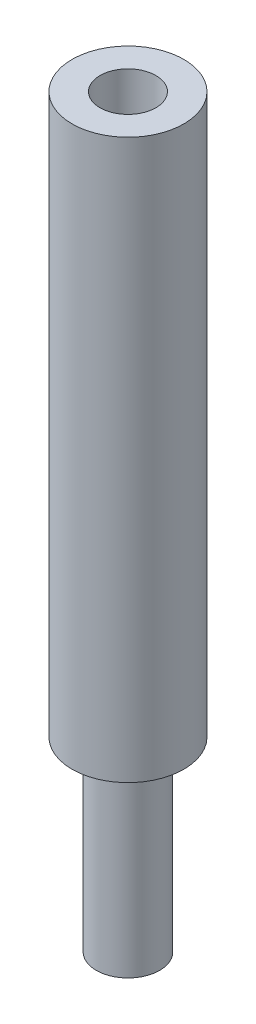
ISO-10303-21;
HEADER;
FILE_DESCRIPTION(('STEP AP214'),'2;1');
FILE_NAME('part.step','',(''),(''),'','','');
FILE_SCHEMA(('AUTOMOTIVE_DESIGN { 1 0 10303 214 1 1 1 1 }'));
ENDSEC;
DATA;
#1=APPLICATION_CONTEXT('core data for automotive mechanical design processes');
#2=APPLICATION_PROTOCOL_DEFINITION('international standard','automotive_design',2000,#1);
#3=PRODUCT_CONTEXT('',#1,'mechanical');
#4=PRODUCT('Part','Part','',(#3));
#5=PRODUCT_RELATED_PRODUCT_CATEGORY('part','',(#4));
#6=PRODUCT_DEFINITION_FORMATION('','',#4);
#7=PRODUCT_DEFINITION_CONTEXT('part definition',#1,'design');
#8=PRODUCT_DEFINITION('design','',#6,#7);
#9=PRODUCT_DEFINITION_SHAPE('','',#8);
#10=(LENGTH_UNIT() NAMED_UNIT(*) SI_UNIT(.MILLI.,.METRE.));
#11=(NAMED_UNIT(*) PLANE_ANGLE_UNIT() SI_UNIT($,.RADIAN.));
#12=(NAMED_UNIT(*) SI_UNIT($,.STERADIAN.) SOLID_ANGLE_UNIT());
#13=UNCERTAINTY_MEASURE_WITH_UNIT(LENGTH_MEASURE(1.E-05),#10,'distance_accuracy_value','');
#14=(GEOMETRIC_REPRESENTATION_CONTEXT(3) GLOBAL_UNCERTAINTY_ASSIGNED_CONTEXT((#13)) GLOBAL_UNIT_ASSIGNED_CONTEXT((#10,
#11,#12)) REPRESENTATION_CONTEXT('',''));
#15=CARTESIAN_POINT('',(0.,0.,0.));
#16=DIRECTION('',(0.,0.,1.));
#17=DIRECTION('',(1.,0.,0.));
#18=AXIS2_PLACEMENT_3D('',#15,#16,#17);
#19=CARTESIAN_POINT('',(0.,10.,0.));
#20=DIRECTION('',(0.,-1.,0.));
#21=DIRECTION('',(0.,0.,-1.));
#22=AXIS2_PLACEMENT_3D('',#19,#20,#21);
#23=CYLINDRICAL_SURFACE('',#22,1.7);
#24=CARTESIAN_POINT('',(0.,10.,0.));
#25=DIRECTION('',(0.,1.,0.));
#26=DIRECTION('',(0.,0.,1.));
#27=AXIS2_PLACEMENT_3D('',#24,#25,#26);
#28=CIRCLE('',#27,1.7);
#29=CARTESIAN_POINT('',(0.,10.,1.7));
#30=VERTEX_POINT('',#29);
#31=EDGE_CURVE('E10',#30,#30,#28,.T.);
#32=ORIENTED_EDGE('',*,*,#31,.F.);
#33=EDGE_LOOP('',(#32));
#34=FACE_BOUND('',#33,.T.);
#35=CARTESIAN_POINT('',(0.,0.,0.));
#36=DIRECTION('',(0.,1.,0.));
#37=DIRECTION('',(0.,0.,1.));
#38=AXIS2_PLACEMENT_3D('',#35,#36,#37);
#39=CIRCLE('',#38,1.7);
#40=CARTESIAN_POINT('',(0.,0.,1.7));
#41=VERTEX_POINT('',#40);
#42=EDGE_CURVE('E45',#41,#41,#39,.T.);
#43=ORIENTED_EDGE('',*,*,#42,.T.);
#44=EDGE_LOOP('',(#43));
#45=FACE_BOUND('',#44,.T.);
#46=ADVANCED_FACE('F42',(#34,#45),#23,.T.);
#47=CARTESIAN_POINT('',(0.,0.,0.));
#48=DIRECTION('',(0.,1.,0.));
#49=DIRECTION('',(0.,0.,1.));
#50=AXIS2_PLACEMENT_3D('',#47,#48,#49);
#51=PLANE('',#50);
#52=ORIENTED_EDGE('',*,*,#42,.F.);
#53=EDGE_LOOP('',(#52));
#54=FACE_BOUND('',#53,.T.);
#55=ADVANCED_FACE('F90',(#54),#51,.F.);
#56=CARTESIAN_POINT('',(0.,40.,0.));
#57=DIRECTION('',(0.,-1.,0.));
#58=DIRECTION('',(0.,0.,-1.));
#59=AXIS2_PLACEMENT_3D('',#56,#57,#58);
#60=CYLINDRICAL_SURFACE('',#59,3.);
#61=CARTESIAN_POINT('',(0.,40.,0.));
#62=DIRECTION('',(0.,1.,0.));
#63=DIRECTION('',(0.,0.,1.));
#64=AXIS2_PLACEMENT_3D('',#61,#62,#63);
#65=CIRCLE('',#64,3.);
#66=CARTESIAN_POINT('',(0.,40.,3.));
#67=VERTEX_POINT('',#66);
#68=EDGE_CURVE('E54',#67,#67,#65,.T.);
#69=ORIENTED_EDGE('',*,*,#68,.F.);
#70=EDGE_LOOP('',(#69));
#71=FACE_BOUND('',#70,.T.);
#72=CARTESIAN_POINT('',(0.,10.,0.));
#73=DIRECTION('',(0.,1.,0.));
#74=DIRECTION('',(0.,0.,1.));
#75=AXIS2_PLACEMENT_3D('',#72,#73,#74);
#76=CIRCLE('',#75,3.);
#77=CARTESIAN_POINT('',(0.,10.,3.));
#78=VERTEX_POINT('',#77);
#79=EDGE_CURVE('E56',#78,#78,#76,.T.);
#80=ORIENTED_EDGE('',*,*,#79,.T.);
#81=EDGE_LOOP('',(#80));
#82=FACE_BOUND('',#81,.T.);
#83=ADVANCED_FACE('F84',(#71,#82),#60,.T.);
#84=CARTESIAN_POINT('',(0.,40.,0.));
#85=DIRECTION('',(0.,1.,0.));
#86=DIRECTION('',(0.,0.,1.));
#87=AXIS2_PLACEMENT_3D('',#84,#85,#86);
#88=PLANE('',#87);
#89=CARTESIAN_POINT('',(0.,40.,0.));
#90=DIRECTION('',(0.,1.,0.));
#91=DIRECTION('',(0.,0.,1.));
#92=AXIS2_PLACEMENT_3D('',#89,#90,#91);
#93=CIRCLE('',#92,1.5);
#94=CARTESIAN_POINT('',(0.,40.,1.5));
#95=VERTEX_POINT('',#94);
#96=EDGE_CURVE('E64',#95,#95,#93,.T.);
#97=ORIENTED_EDGE('',*,*,#96,.F.);
#98=EDGE_LOOP('',(#97));
#99=FACE_BOUND('',#98,.T.);
#100=ORIENTED_EDGE('',*,*,#68,.T.);
#101=EDGE_LOOP('',(#100));
#102=FACE_BOUND('',#101,.T.);
#103=ADVANCED_FACE('F81',(#99,#102),#88,.T.);
#104=CARTESIAN_POINT('',(0.,10.,0.));
#105=DIRECTION('',(0.,1.,0.));
#106=DIRECTION('',(0.,0.,1.));
#107=AXIS2_PLACEMENT_3D('',#104,#105,#106);
#108=PLANE('',#107);
#109=ORIENTED_EDGE('',*,*,#31,.T.);
#110=EDGE_LOOP('',(#109));
#111=FACE_BOUND('',#110,.T.);
#112=ORIENTED_EDGE('',*,*,#79,.F.);
#113=EDGE_LOOP('',(#112));
#114=FACE_BOUND('',#113,.T.);
#115=ADVANCED_FACE('F77',(#111,#114),#108,.F.);
#116=CARTESIAN_POINT('',(0.,32.,0.));
#117=DIRECTION('',(0.,1.,0.));
#118=DIRECTION('',(0.,0.,1.));
#119=AXIS2_PLACEMENT_3D('',#116,#117,#118);
#120=CYLINDRICAL_SURFACE('',#119,1.5);
#121=CARTESIAN_POINT('',(0.,32.,0.));
#122=DIRECTION('',(0.,1.,0.));
#123=DIRECTION('',(0.,0.,1.));
#124=AXIS2_PLACEMENT_3D('',#121,#122,#123);
#125=CIRCLE('',#124,1.5);
#126=CARTESIAN_POINT('',(0.,32.,1.5));
#127=VERTEX_POINT('',#126);
#128=EDGE_CURVE('E60',#127,#127,#125,.T.);
#129=ORIENTED_EDGE('',*,*,#128,.F.);
#130=EDGE_LOOP('',(#129));
#131=FACE_BOUND('',#130,.T.);
#132=ORIENTED_EDGE('',*,*,#96,.T.);
#133=EDGE_LOOP('',(#132));
#134=FACE_BOUND('',#133,.T.);
#135=ADVANCED_FACE('F74',(#131,#134),#120,.F.);
#136=CARTESIAN_POINT('',(0.,32.,0.));
#137=DIRECTION('',(0.,1.,0.));
#138=DIRECTION('',(0.,0.,1.));
#139=AXIS2_PLACEMENT_3D('',#136,#137,#138);
#140=PLANE('',#139);
#141=ORIENTED_EDGE('',*,*,#128,.T.);
#142=EDGE_LOOP('',(#141));
#143=FACE_BOUND('',#142,.T.);
#144=ADVANCED_FACE('F72',(#143),#140,.T.);
#145=CLOSED_SHELL('',(#46,#55,#83,#103,#115,#135,#144));
#146=MANIFOLD_SOLID_BREP('B2',#145);
#147=ADVANCED_BREP_SHAPE_REPRESENTATION('',(#18,#146),#14);
#148=SHAPE_DEFINITION_REPRESENTATION(#9,#147);
ENDSEC;
END-ISO-10303-21;
